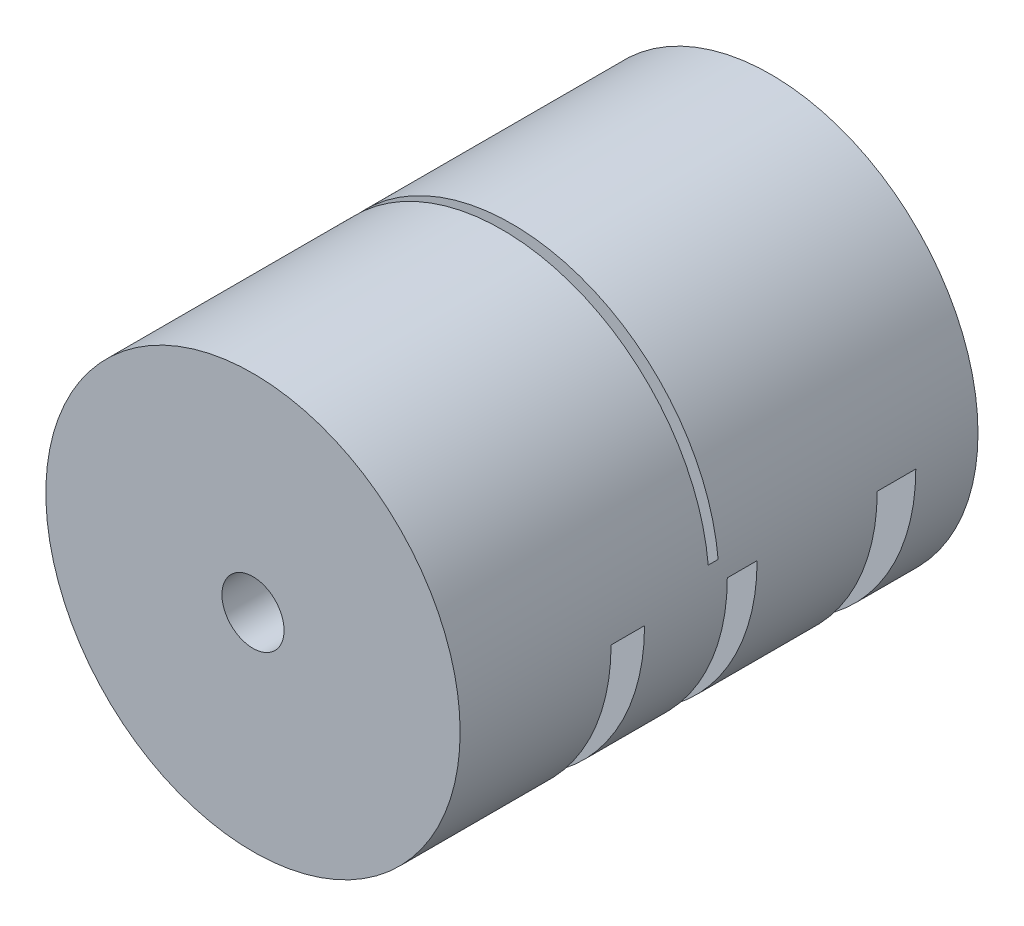
ISO-10303-21;
HEADER;
FILE_DESCRIPTION(('STEP AP214'),'2;1');
FILE_NAME('part.step','',(''),(''),'','','');
FILE_SCHEMA(('AUTOMOTIVE_DESIGN { 1 0 10303 214 1 1 1 1 }'));
ENDSEC;
DATA;
#1=APPLICATION_CONTEXT('core data for automotive mechanical design processes');
#2=APPLICATION_PROTOCOL_DEFINITION('international standard','automotive_design',2000,#1);
#3=PRODUCT_CONTEXT('',#1,'mechanical');
#4=PRODUCT('Part','Part','',(#3));
#5=PRODUCT_RELATED_PRODUCT_CATEGORY('part','',(#4));
#6=PRODUCT_DEFINITION_FORMATION('','',#4);
#7=PRODUCT_DEFINITION_CONTEXT('part definition',#1,'design');
#8=PRODUCT_DEFINITION('design','',#6,#7);
#9=PRODUCT_DEFINITION_SHAPE('','',#8);
#10=(LENGTH_UNIT() NAMED_UNIT(*) SI_UNIT(.MILLI.,.METRE.));
#11=(NAMED_UNIT(*) PLANE_ANGLE_UNIT() SI_UNIT($,.RADIAN.));
#12=(NAMED_UNIT(*) SI_UNIT($,.STERADIAN.) SOLID_ANGLE_UNIT());
#13=UNCERTAINTY_MEASURE_WITH_UNIT(LENGTH_MEASURE(1.E-05),#10,'distance_accuracy_value','');
#14=(GEOMETRIC_REPRESENTATION_CONTEXT(3) GLOBAL_UNCERTAINTY_ASSIGNED_CONTEXT((#13)) GLOBAL_UNIT_ASSIGNED_CONTEXT((#10,
#11,#12)) REPRESENTATION_CONTEXT('',''));
#15=CARTESIAN_POINT('',(0.,0.,0.));
#16=DIRECTION('',(0.,0.,1.));
#17=DIRECTION('',(1.,0.,0.));
#18=AXIS2_PLACEMENT_3D('',#15,#16,#17);
#19=CARTESIAN_POINT('',(0.,0.,25.));
#20=DIRECTION('',(0.,0.,-1.));
#21=DIRECTION('',(-1.,0.,0.));
#22=AXIS2_PLACEMENT_3D('',#19,#20,#21);
#23=CYLINDRICAL_SURFACE('',#22,3.);
#24=CARTESIAN_POINT('',(0.,0.,10.4261161368343));
#25=DIRECTION('',(0.,0.,1.));
#26=DIRECTION('',(1.,0.,0.));
#27=AXIS2_PLACEMENT_3D('',#24,#25,#26);
#28=CIRCLE('',#27,3.);
#29=CARTESIAN_POINT('',(-3.,0.,10.4261161368343));
#30=VERTEX_POINT('',#29);
#31=CARTESIAN_POINT('',(3.,0.,10.4261161368343));
#32=VERTEX_POINT('',#31);
#33=EDGE_CURVE('E62',#30,#32,#28,.T.);
#34=ORIENTED_EDGE('',*,*,#33,.F.);
#35=DIRECTION('',(0.,0.,-1.));
#36=VECTOR('',#35,1.);
#37=CARTESIAN_POINT('',(-3.,0.,25.));
#38=LINE('',#37,#36);
#39=CARTESIAN_POINT('',(-3.,0.,7.19606312437256));
#40=VERTEX_POINT('',#39);
#41=EDGE_CURVE('E268',#40,#30,#38,.F.);
#42=ORIENTED_EDGE('',*,*,#41,.F.);
#43=CARTESIAN_POINT('',(0.,0.,7.19606312437256));
#44=DIRECTION('',(0.,0.,-1.));
#45=DIRECTION('',(-1.,0.,0.));
#46=AXIS2_PLACEMENT_3D('',#43,#44,#45);
#47=CIRCLE('',#46,3.);
#48=CARTESIAN_POINT('',(3.,0.,7.19606312437256));
#49=VERTEX_POINT('',#48);
#50=EDGE_CURVE('E270',#49,#40,#47,.T.);
#51=ORIENTED_EDGE('',*,*,#50,.F.);
#52=DIRECTION('',(0.,0.,-1.));
#53=VECTOR('',#52,1.);
#54=CARTESIAN_POINT('',(3.,0.,25.));
#55=LINE('',#54,#53);
#56=EDGE_CURVE('E274',#32,#49,#55,.T.);
#57=ORIENTED_EDGE('',*,*,#56,.F.);
#58=EDGE_LOOP('',(#34,#42,#51,#57));
#59=FACE_BOUND('',#58,.T.);
#60=CARTESIAN_POINT('',(0.,0.,-0.793981947598436));
#61=DIRECTION('',(0.,0.,1.));
#62=DIRECTION('',(1.,0.,0.));
#63=AXIS2_PLACEMENT_3D('',#60,#61,#62);
#64=CIRCLE('',#63,3.);
#65=CARTESIAN_POINT('',(-3.,0.,-0.793981947598436));
#66=VERTEX_POINT('',#65);
#67=CARTESIAN_POINT('',(3.,0.,-0.793981947598436));
#68=VERTEX_POINT('',#67);
#69=EDGE_CURVE('E259',#66,#68,#64,.T.);
#70=ORIENTED_EDGE('',*,*,#69,.F.);
#71=DIRECTION('',(0.,0.,-1.));
#72=VECTOR('',#71,1.);
#73=CARTESIAN_POINT('',(-3.,0.,25.));
#74=LINE('',#73,#72);
#75=CARTESIAN_POINT('',(-3.,0.,-3.67142087285081));
#76=VERTEX_POINT('',#75);
#77=EDGE_CURVE('E256',#76,#66,#74,.F.);
#78=ORIENTED_EDGE('',*,*,#77,.F.);
#79=CARTESIAN_POINT('',(0.,0.,-3.67142087285081));
#80=DIRECTION('',(0.,0.,-1.));
#81=DIRECTION('',(-1.,0.,0.));
#82=AXIS2_PLACEMENT_3D('',#79,#80,#81);
#83=CIRCLE('',#82,3.);
#84=CARTESIAN_POINT('',(3.,0.,-3.67142087285081));
#85=VERTEX_POINT('',#84);
#86=EDGE_CURVE('E262',#85,#76,#83,.T.);
#87=ORIENTED_EDGE('',*,*,#86,.F.);
#88=DIRECTION('',(0.,0.,-1.));
#89=VECTOR('',#88,1.);
#90=CARTESIAN_POINT('',(3.,0.,25.));
#91=LINE('',#90,#89);
#92=EDGE_CURVE('E265',#68,#85,#91,.T.);
#93=ORIENTED_EDGE('',*,*,#92,.F.);
#94=EDGE_LOOP('',(#70,#78,#87,#93));
#95=FACE_BOUND('',#94,.T.);
#96=CARTESIAN_POINT('',(0.,0.,25.));
#97=DIRECTION('',(0.,0.,-1.));
#98=DIRECTION('',(-1.,0.,0.));
#99=AXIS2_PLACEMENT_3D('',#96,#97,#98);
#100=CIRCLE('',#99,3.);
#101=CARTESIAN_POINT('',(-3.,0.,25.));
#102=VERTEX_POINT('',#101);
#103=EDGE_CURVE('E249',#102,#102,#100,.T.);
#104=ORIENTED_EDGE('',*,*,#103,.F.);
#105=EDGE_LOOP('',(#104));
#106=FACE_BOUND('',#105,.T.);
#107=DIRECTION('',(0.,0.,-1.));
#108=VECTOR('',#107,1.);
#109=CARTESIAN_POINT('',(3.,0.,25.));
#110=LINE('',#109,#108);
#111=CARTESIAN_POINT('',(3.,0.,0.954143846726332));
#112=VERTEX_POINT('',#111);
#113=CARTESIAN_POINT('',(3.,0.,0.));
#114=VERTEX_POINT('',#113);
#115=EDGE_CURVE('E48',#112,#114,#110,.T.);
#116=ORIENTED_EDGE('',*,*,#115,.T.);
#117=CARTESIAN_POINT('',(0.,0.,0.));
#118=DIRECTION('',(0.,0.,1.));
#119=DIRECTION('',(1.,0.,0.));
#120=AXIS2_PLACEMENT_3D('',#117,#118,#119);
#121=CIRCLE('',#120,3.);
#122=CARTESIAN_POINT('',(-3.,0.,0.));
#123=VERTEX_POINT('',#122);
#124=EDGE_CURVE('E252',#114,#123,#121,.T.);
#125=ORIENTED_EDGE('',*,*,#124,.T.);
#126=DIRECTION('',(0.,0.,-1.));
#127=VECTOR('',#126,1.);
#128=CARTESIAN_POINT('',(-3.,0.,25.));
#129=LINE('',#128,#127);
#130=CARTESIAN_POINT('',(-3.,0.,0.954143846726332));
#131=VERTEX_POINT('',#130);
#132=EDGE_CURVE('E230',#123,#131,#129,.F.);
#133=ORIENTED_EDGE('',*,*,#132,.T.);
#134=CARTESIAN_POINT('',(0.,0.,0.954143846726332));
#135=DIRECTION('',(0.,0.,-1.));
#136=DIRECTION('',(-1.,0.,0.));
#137=AXIS2_PLACEMENT_3D('',#134,#135,#136);
#138=CIRCLE('',#137,3.);
#139=EDGE_CURVE('E254',#131,#112,#138,.T.);
#140=ORIENTED_EDGE('',*,*,#139,.T.);
#141=EDGE_LOOP('',(#116,#125,#133,#140));
#142=FACE_BOUND('',#141,.T.);
#143=CARTESIAN_POINT('',(0.,0.,-15.));
#144=DIRECTION('',(0.,0.,-1.));
#145=DIRECTION('',(-1.,0.,0.));
#146=AXIS2_PLACEMENT_3D('',#143,#144,#145);
#147=CIRCLE('',#146,3.);
#148=CARTESIAN_POINT('',(-3.,0.,-15.));
#149=VERTEX_POINT('',#148);
#150=EDGE_CURVE('E234',#149,#149,#147,.F.);
#151=ORIENTED_EDGE('',*,*,#150,.F.);
#152=EDGE_LOOP('',(#151));
#153=FACE_BOUND('',#152,.T.);
#154=ADVANCED_FACE('F40',(#59,#95,#106,#142,#153),#23,.F.);
#155=CARTESIAN_POINT('',(0.,0.,0.));
#156=DIRECTION('',(0.,1.,0.));
#157=DIRECTION('',(0.,0.,1.));
#158=AXIS2_PLACEMENT_3D('',#155,#156,#157);
#159=PLANE('',#158);
#160=DIRECTION('',(1.,0.,0.));
#161=VECTOR('',#160,1.);
#162=CARTESIAN_POINT('',(23.2953475946034,0.,10.4261161368343));
#163=LINE('',#162,#161);
#164=CARTESIAN_POINT('',(20.,0.,10.4261161368343));
#165=VERTEX_POINT('',#164);
#166=EDGE_CURVE('E218',#32,#165,#163,.T.);
#167=ORIENTED_EDGE('',*,*,#166,.F.);
#168=ORIENTED_EDGE('',*,*,#56,.T.);
#169=DIRECTION('',(-1.,0.,0.));
#170=VECTOR('',#169,1.);
#171=CARTESIAN_POINT('',(23.2953475946034,0.,7.19606312437256));
#172=LINE('',#171,#170);
#173=CARTESIAN_POINT('',(20.,0.,7.19606312437256));
#174=VERTEX_POINT('',#173);
#175=EDGE_CURVE('E215',#174,#49,#172,.T.);
#176=ORIENTED_EDGE('',*,*,#175,.F.);
#177=DIRECTION('',(0.,0.,-1.));
#178=VECTOR('',#177,1.);
#179=CARTESIAN_POINT('',(20.,0.,25.));
#180=LINE('',#179,#178);
#181=EDGE_CURVE('E190',#174,#165,#180,.F.);
#182=ORIENTED_EDGE('',*,*,#181,.T.);
#183=EDGE_LOOP('',(#167,#168,#176,#182));
#184=FACE_BOUND('',#183,.T.);
#185=ADVANCED_FACE('F342',(#184),#159,.F.);
#186=CARTESIAN_POINT('',(0.,0.,0.));
#187=DIRECTION('',(0.,1.,0.));
#188=DIRECTION('',(0.,0.,1.));
#189=AXIS2_PLACEMENT_3D('',#186,#187,#188);
#190=PLANE('',#189);
#191=DIRECTION('',(1.,0.,0.));
#192=VECTOR('',#191,1.);
#193=CARTESIAN_POINT('',(-22.0590214300708,0.,-0.793981947598436));
#194=LINE('',#193,#192);
#195=CARTESIAN_POINT('',(20.,0.,-0.793981947598436));
#196=VERTEX_POINT('',#195);
#197=EDGE_CURVE('E193',#68,#196,#194,.T.);
#198=ORIENTED_EDGE('',*,*,#197,.F.);
#199=ORIENTED_EDGE('',*,*,#92,.T.);
#200=DIRECTION('',(-1.,0.,0.));
#201=VECTOR('',#200,1.);
#202=CARTESIAN_POINT('',(-22.0590214300708,0.,-3.67142087285081));
#203=LINE('',#202,#201);
#204=CARTESIAN_POINT('',(20.,0.,-3.67142087285081));
#205=VERTEX_POINT('',#204);
#206=EDGE_CURVE('E198',#205,#85,#203,.T.);
#207=ORIENTED_EDGE('',*,*,#206,.F.);
#208=DIRECTION('',(0.,0.,-1.));
#209=VECTOR('',#208,1.);
#210=CARTESIAN_POINT('',(20.,0.,25.));
#211=LINE('',#210,#209);
#212=EDGE_CURVE('E204',#205,#196,#211,.F.);
#213=ORIENTED_EDGE('',*,*,#212,.T.);
#214=EDGE_LOOP('',(#198,#199,#207,#213));
#215=FACE_BOUND('',#214,.T.);
#216=ADVANCED_FACE('F347',(#215),#190,.F.);
#217=CARTESIAN_POINT('',(0.,0.,0.));
#218=DIRECTION('',(0.,1.,0.));
#219=DIRECTION('',(0.,0.,1.));
#220=AXIS2_PLACEMENT_3D('',#217,#218,#219);
#221=PLANE('',#220);
#222=DIRECTION('',(1.,0.,0.));
#223=VECTOR('',#222,1.);
#224=CARTESIAN_POINT('',(-22.0590214300708,0.,-15.2691684318328));
#225=LINE('',#224,#223);
#226=CARTESIAN_POINT('',(4.,0.,-15.2691684318328));
#227=VERTEX_POINT('',#226);
#228=CARTESIAN_POINT('',(20.,0.,-15.2691684318328));
#229=VERTEX_POINT('',#228);
#230=EDGE_CURVE('E178',#227,#229,#225,.T.);
#231=ORIENTED_EDGE('',*,*,#230,.F.);
#232=DIRECTION('',(0.,0.,-1.));
#233=VECTOR('',#232,1.);
#234=CARTESIAN_POINT('',(4.,0.,-15.));
#235=LINE('',#234,#233);
#236=CARTESIAN_POINT('',(4.,0.,-18.9939233758882));
#237=VERTEX_POINT('',#236);
#238=EDGE_CURVE('E170',#227,#237,#235,.T.);
#239=ORIENTED_EDGE('',*,*,#238,.T.);
#240=DIRECTION('',(-1.,0.,0.));
#241=VECTOR('',#240,1.);
#242=CARTESIAN_POINT('',(-22.0590214300708,0.,-18.9939233758882));
#243=LINE('',#242,#241);
#244=CARTESIAN_POINT('',(20.,0.,-18.9939233758882));
#245=VERTEX_POINT('',#244);
#246=EDGE_CURVE('E169',#245,#237,#243,.T.);
#247=ORIENTED_EDGE('',*,*,#246,.F.);
#248=DIRECTION('',(0.,0.,-1.));
#249=VECTOR('',#248,1.);
#250=CARTESIAN_POINT('',(20.,0.,25.));
#251=LINE('',#250,#249);
#252=EDGE_CURVE('E183',#245,#229,#251,.F.);
#253=ORIENTED_EDGE('',*,*,#252,.T.);
#254=EDGE_LOOP('',(#231,#239,#247,#253));
#255=FACE_BOUND('',#254,.T.);
#256=ADVANCED_FACE('F311',(#255),#221,.F.);
#257=CARTESIAN_POINT('',(0.,0.,0.));
#258=DIRECTION('',(0.,1.,0.));
#259=DIRECTION('',(0.,0.,1.));
#260=AXIS2_PLACEMENT_3D('',#257,#258,#259);
#261=PLANE('',#260);
#262=ORIENTED_EDGE('',*,*,#115,.F.);
#263=DIRECTION('',(1.,0.,0.));
#264=VECTOR('',#263,1.);
#265=CARTESIAN_POINT('',(-20.,0.,0.954143846726332));
#266=LINE('',#265,#264);
#267=CARTESIAN_POINT('',(19.9098016016895,0.,0.954143846726332));
#268=VERTEX_POINT('',#267);
#269=EDGE_CURVE('E289',#112,#268,#266,.T.);
#270=ORIENTED_EDGE('',*,*,#269,.T.);
#271=DIRECTION('',(0.,0.,-1.));
#272=VECTOR('',#271,1.);
#273=CARTESIAN_POINT('',(19.9098016016895,0.,0.));
#274=LINE('',#273,#272);
#275=CARTESIAN_POINT('',(19.9098016016895,0.,0.));
#276=VERTEX_POINT('',#275);
#277=EDGE_CURVE('E293',#268,#276,#274,.T.);
#278=ORIENTED_EDGE('',*,*,#277,.T.);
#279=DIRECTION('',(-1.,0.,0.));
#280=VECTOR('',#279,1.);
#281=CARTESIAN_POINT('',(-20.,0.,0.));
#282=LINE('',#281,#280);
#283=EDGE_CURVE('E297',#276,#114,#282,.T.);
#284=ORIENTED_EDGE('',*,*,#283,.T.);
#285=EDGE_LOOP('',(#262,#270,#278,#284));
#286=FACE_BOUND('',#285,.T.);
#287=ADVANCED_FACE('F316',(#286),#261,.T.);
#288=CARTESIAN_POINT('',(0.,0.,25.));
#289=DIRECTION('',(0.,0.,-1.));
#290=DIRECTION('',(-1.,0.,0.));
#291=AXIS2_PLACEMENT_3D('',#288,#289,#290);
#292=CYLINDRICAL_SURFACE('',#291,20.);
#293=CARTESIAN_POINT('',(0.,0.,-25.));
#294=DIRECTION('',(0.,0.,1.));
#295=DIRECTION('',(1.,0.,0.));
#296=AXIS2_PLACEMENT_3D('',#293,#294,#295);
#297=CIRCLE('',#296,20.);
#298=CARTESIAN_POINT('',(20.,0.,-25.));
#299=VERTEX_POINT('',#298);
#300=EDGE_CURVE('E186',#299,#299,#297,.T.);
#301=ORIENTED_EDGE('',*,*,#300,.T.);
#302=EDGE_LOOP('',(#301));
#303=FACE_BOUND('',#302,.T.);
#304=CARTESIAN_POINT('',(0.,0.,25.));
#305=DIRECTION('',(0.,0.,1.));
#306=DIRECTION('',(1.,0.,0.));
#307=AXIS2_PLACEMENT_3D('',#304,#305,#306);
#308=CIRCLE('',#307,20.);
#309=CARTESIAN_POINT('',(20.,0.,25.));
#310=VERTEX_POINT('',#309);
#311=EDGE_CURVE('E227',#310,#310,#308,.T.);
#312=ORIENTED_EDGE('',*,*,#311,.F.);
#313=EDGE_LOOP('',(#312));
#314=FACE_BOUND('',#313,.T.);
#315=CARTESIAN_POINT('',(0.,0.,10.4261161368343));
#316=DIRECTION('',(0.,0.,1.));
#317=DIRECTION('',(1.,0.,0.));
#318=AXIS2_PLACEMENT_3D('',#315,#316,#317);
#319=CIRCLE('',#318,20.);
#320=CARTESIAN_POINT('',(-20.,0.,10.4261161368343));
#321=VERTEX_POINT('',#320);
#322=EDGE_CURVE('E211',#165,#321,#319,.F.);
#323=ORIENTED_EDGE('',*,*,#322,.F.);
#324=ORIENTED_EDGE('',*,*,#181,.F.);
#325=CARTESIAN_POINT('',(0.,0.,7.19606312437256));
#326=DIRECTION('',(0.,0.,-1.));
#327=DIRECTION('',(-1.,0.,0.));
#328=AXIS2_PLACEMENT_3D('',#325,#326,#327);
#329=CIRCLE('',#328,20.);
#330=CARTESIAN_POINT('',(-20.,0.,7.19606312437256));
#331=VERTEX_POINT('',#330);
#332=EDGE_CURVE('E208',#331,#174,#329,.F.);
#333=ORIENTED_EDGE('',*,*,#332,.F.);
#334=DIRECTION('',(0.,0.,-1.));
#335=VECTOR('',#334,1.);
#336=CARTESIAN_POINT('',(-20.,0.,25.));
#337=LINE('',#336,#335);
#338=EDGE_CURVE('E222',#321,#331,#337,.T.);
#339=ORIENTED_EDGE('',*,*,#338,.F.);
#340=EDGE_LOOP('',(#323,#324,#333,#339));
#341=FACE_BOUND('',#340,.T.);
#342=CARTESIAN_POINT('',(0.,0.,-0.793981947598436));
#343=DIRECTION('',(0.,0.,1.));
#344=DIRECTION('',(1.,0.,0.));
#345=AXIS2_PLACEMENT_3D('',#342,#343,#344);
#346=CIRCLE('',#345,20.);
#347=CARTESIAN_POINT('',(-20.,0.,-0.793981947598436));
#348=VERTEX_POINT('',#347);
#349=EDGE_CURVE('E187',#196,#348,#346,.F.);
#350=ORIENTED_EDGE('',*,*,#349,.F.);
#351=ORIENTED_EDGE('',*,*,#212,.F.);
#352=CARTESIAN_POINT('',(0.,0.,-3.67142087285081));
#353=DIRECTION('',(0.,0.,-1.));
#354=DIRECTION('',(-1.,0.,0.));
#355=AXIS2_PLACEMENT_3D('',#352,#353,#354);
#356=CIRCLE('',#355,20.);
#357=CARTESIAN_POINT('',(-20.,0.,-3.67142087285081));
#358=VERTEX_POINT('',#357);
#359=EDGE_CURVE('E189',#358,#205,#356,.F.);
#360=ORIENTED_EDGE('',*,*,#359,.F.);
#361=DIRECTION('',(0.,0.,-1.));
#362=VECTOR('',#361,1.);
#363=CARTESIAN_POINT('',(-20.,0.,25.));
#364=LINE('',#363,#362);
#365=EDGE_CURVE('E201',#348,#358,#364,.T.);
#366=ORIENTED_EDGE('',*,*,#365,.F.);
#367=EDGE_LOOP('',(#350,#351,#360,#366));
#368=FACE_BOUND('',#367,.T.);
#369=CARTESIAN_POINT('',(0.,0.,-15.2691684318328));
#370=DIRECTION('',(0.,0.,1.));
#371=DIRECTION('',(1.,0.,0.));
#372=AXIS2_PLACEMENT_3D('',#369,#370,#371);
#373=CIRCLE('',#372,20.);
#374=CARTESIAN_POINT('',(-20.,0.,-15.2691684318328));
#375=VERTEX_POINT('',#374);
#376=EDGE_CURVE('E207',#229,#375,#373,.F.);
#377=ORIENTED_EDGE('',*,*,#376,.F.);
#378=ORIENTED_EDGE('',*,*,#252,.F.);
#379=CARTESIAN_POINT('',(0.,0.,-18.9939233758882));
#380=DIRECTION('',(0.,0.,-1.));
#381=DIRECTION('',(-1.,0.,0.));
#382=AXIS2_PLACEMENT_3D('',#379,#380,#381);
#383=CIRCLE('',#382,20.);
#384=CARTESIAN_POINT('',(-20.,0.,-18.9939233758882));
#385=VERTEX_POINT('',#384);
#386=EDGE_CURVE('E304',#385,#245,#383,.F.);
#387=ORIENTED_EDGE('',*,*,#386,.F.);
#388=DIRECTION('',(0.,0.,-1.));
#389=VECTOR('',#388,1.);
#390=CARTESIAN_POINT('',(-20.,0.,25.));
#391=LINE('',#390,#389);
#392=EDGE_CURVE('E174',#375,#385,#391,.T.);
#393=ORIENTED_EDGE('',*,*,#392,.F.);
#394=EDGE_LOOP('',(#377,#378,#387,#393));
#395=FACE_BOUND('',#394,.T.);
#396=CARTESIAN_POINT('',(0.,0.,0.954143846726332));
#397=DIRECTION('',(0.,0.,-1.));
#398=DIRECTION('',(-1.,0.,0.));
#399=AXIS2_PLACEMENT_3D('',#396,#397,#398);
#400=CIRCLE('',#399,20.);
#401=CARTESIAN_POINT('',(19.9098016016895,1.89731393853601,0.954143846726332));
#402=VERTEX_POINT('',#401);
#403=CARTESIAN_POINT('',(-20.,0.,0.954143846726332));
#404=VERTEX_POINT('',#403);
#405=EDGE_CURVE('E283',#402,#404,#400,.F.);
#406=ORIENTED_EDGE('',*,*,#405,.T.);
#407=DIRECTION('',(0.,0.,1.));
#408=VECTOR('',#407,1.);
#409=CARTESIAN_POINT('',(-20.,0.,0.));
#410=LINE('',#409,#408);
#411=CARTESIAN_POINT('',(-20.,0.,0.));
#412=VERTEX_POINT('',#411);
#413=EDGE_CURVE('E286',#412,#404,#410,.T.);
#414=ORIENTED_EDGE('',*,*,#413,.F.);
#415=CARTESIAN_POINT('',(0.,0.,0.));
#416=DIRECTION('',(0.,0.,1.));
#417=DIRECTION('',(1.,0.,0.));
#418=AXIS2_PLACEMENT_3D('',#415,#416,#417);
#419=CIRCLE('',#418,20.);
#420=CARTESIAN_POINT('',(19.9098016016895,1.89731393853601,0.));
#421=VERTEX_POINT('',#420);
#422=EDGE_CURVE('E277',#412,#421,#419,.F.);
#423=ORIENTED_EDGE('',*,*,#422,.T.);
#424=DIRECTION('',(0.,0.,-1.));
#425=VECTOR('',#424,1.);
#426=CARTESIAN_POINT('',(19.9098016016895,1.89731393853601,25.));
#427=LINE('',#426,#425);
#428=EDGE_CURVE('E280',#421,#402,#427,.F.);
#429=ORIENTED_EDGE('',*,*,#428,.T.);
#430=EDGE_LOOP('',(#406,#414,#423,#429));
#431=FACE_BOUND('',#430,.T.);
#432=ADVANCED_FACE('F42',(#303,#314,#341,#368,#395,#431),#292,.T.);
#433=CARTESIAN_POINT('',(0.,0.,25.));
#434=DIRECTION('',(0.,0.,1.));
#435=DIRECTION('',(1.,0.,0.));
#436=AXIS2_PLACEMENT_3D('',#433,#434,#435);
#437=PLANE('',#436);
#438=ORIENTED_EDGE('',*,*,#103,.T.);
#439=EDGE_LOOP('',(#438));
#440=FACE_BOUND('',#439,.T.);
#441=ORIENTED_EDGE('',*,*,#311,.T.);
#442=EDGE_LOOP('',(#441));
#443=FACE_BOUND('',#442,.T.);
#444=ADVANCED_FACE('F315',(#440,#443),#437,.T.);
#445=CARTESIAN_POINT('',(0.,0.,-25.));
#446=DIRECTION('',(0.,0.,1.));
#447=DIRECTION('',(1.,0.,0.));
#448=AXIS2_PLACEMENT_3D('',#445,#446,#447);
#449=PLANE('',#448);
#450=CARTESIAN_POINT('',(0.,0.,-25.));
#451=DIRECTION('',(0.,0.,-1.));
#452=DIRECTION('',(-1.,0.,0.));
#453=AXIS2_PLACEMENT_3D('',#450,#451,#452);
#454=CIRCLE('',#453,4.);
#455=CARTESIAN_POINT('',(-4.,0.,-25.));
#456=VERTEX_POINT('',#455);
#457=EDGE_CURVE('E241',#456,#456,#454,.T.);
#458=ORIENTED_EDGE('',*,*,#457,.F.);
#459=EDGE_LOOP('',(#458));
#460=FACE_BOUND('',#459,.T.);
#461=ORIENTED_EDGE('',*,*,#300,.F.);
#462=EDGE_LOOP('',(#461));
#463=FACE_BOUND('',#462,.T.);
#464=ADVANCED_FACE('F387',(#460,#463),#449,.F.);
#465=CARTESIAN_POINT('',(23.2953475946034,-20.001,10.4261161368343));
#466=DIRECTION('',(0.,0.,1.));
#467=DIRECTION('',(1.,0.,0.));
#468=AXIS2_PLACEMENT_3D('',#465,#466,#467);
#469=PLANE('',#468);
#470=EDGE_CURVE('E219',#321,#30,#163,.T.);
#471=ORIENTED_EDGE('',*,*,#470,.T.);
#472=ORIENTED_EDGE('',*,*,#33,.T.);
#473=ORIENTED_EDGE('',*,*,#166,.T.);
#474=ORIENTED_EDGE('',*,*,#322,.T.);
#475=EDGE_LOOP('',(#471,#472,#473,#474));
#476=FACE_BOUND('',#475,.T.);
#477=ADVANCED_FACE('F384',(#476),#469,.F.);
#478=CARTESIAN_POINT('',(23.2953475946034,-20.001,7.19606312437256));
#479=DIRECTION('',(0.,0.,-1.));
#480=DIRECTION('',(-1.,0.,0.));
#481=AXIS2_PLACEMENT_3D('',#478,#479,#480);
#482=PLANE('',#481);
#483=ORIENTED_EDGE('',*,*,#175,.T.);
#484=ORIENTED_EDGE('',*,*,#50,.T.);
#485=EDGE_CURVE('E214',#40,#331,#172,.T.);
#486=ORIENTED_EDGE('',*,*,#485,.T.);
#487=ORIENTED_EDGE('',*,*,#332,.T.);
#488=EDGE_LOOP('',(#483,#484,#486,#487));
#489=FACE_BOUND('',#488,.T.);
#490=ADVANCED_FACE('F382',(#489),#482,.F.);
#491=ORIENTED_EDGE('',*,*,#485,.F.);
#492=ORIENTED_EDGE('',*,*,#41,.T.);
#493=ORIENTED_EDGE('',*,*,#470,.F.);
#494=ORIENTED_EDGE('',*,*,#338,.T.);
#495=EDGE_LOOP('',(#491,#492,#493,#494));
#496=FACE_BOUND('',#495,.T.);
#497=ADVANCED_FACE('F350',(#496),#159,.F.);
#498=CARTESIAN_POINT('',(-22.0590214300708,-20.001,-3.67142087285081));
#499=DIRECTION('',(0.,0.,-1.));
#500=DIRECTION('',(-1.,0.,0.));
#501=AXIS2_PLACEMENT_3D('',#498,#499,#500);
#502=PLANE('',#501);
#503=ORIENTED_EDGE('',*,*,#206,.T.);
#504=ORIENTED_EDGE('',*,*,#86,.T.);
#505=EDGE_CURVE('E197',#76,#358,#203,.T.);
#506=ORIENTED_EDGE('',*,*,#505,.T.);
#507=ORIENTED_EDGE('',*,*,#359,.T.);
#508=EDGE_LOOP('',(#503,#504,#506,#507));
#509=FACE_BOUND('',#508,.T.);
#510=ADVANCED_FACE('F374',(#509),#502,.F.);
#511=CARTESIAN_POINT('',(-22.0590214300708,-20.001,-0.793981947598436));
#512=DIRECTION('',(0.,0.,1.));
#513=DIRECTION('',(1.,0.,0.));
#514=AXIS2_PLACEMENT_3D('',#511,#512,#513);
#515=PLANE('',#514);
#516=EDGE_CURVE('E194',#348,#66,#194,.T.);
#517=ORIENTED_EDGE('',*,*,#516,.T.);
#518=ORIENTED_EDGE('',*,*,#69,.T.);
#519=ORIENTED_EDGE('',*,*,#197,.T.);
#520=ORIENTED_EDGE('',*,*,#349,.T.);
#521=EDGE_LOOP('',(#517,#518,#519,#520));
#522=FACE_BOUND('',#521,.T.);
#523=ADVANCED_FACE('F372',(#522),#515,.F.);
#524=ORIENTED_EDGE('',*,*,#505,.F.);
#525=ORIENTED_EDGE('',*,*,#77,.T.);
#526=ORIENTED_EDGE('',*,*,#516,.F.);
#527=ORIENTED_EDGE('',*,*,#365,.T.);
#528=EDGE_LOOP('',(#524,#525,#526,#527));
#529=FACE_BOUND('',#528,.T.);
#530=ADVANCED_FACE('F367',(#529),#190,.F.);
#531=CARTESIAN_POINT('',(-22.0590214300708,-20.001,-18.9939233758882));
#532=DIRECTION('',(0.,0.,-1.));
#533=DIRECTION('',(-1.,0.,0.));
#534=AXIS2_PLACEMENT_3D('',#531,#532,#533);
#535=PLANE('',#534);
#536=ORIENTED_EDGE('',*,*,#246,.T.);
#537=CARTESIAN_POINT('',(0.,0.,-18.9939233758882));
#538=DIRECTION('',(0.,0.,-1.));
#539=DIRECTION('',(-1.,0.,0.));
#540=AXIS2_PLACEMENT_3D('',#537,#538,#539);
#541=CIRCLE('',#540,4.);
#542=CARTESIAN_POINT('',(-4.,0.,-18.9939233758882));
#543=VERTEX_POINT('',#542);
#544=EDGE_CURVE('E157',#237,#543,#541,.T.);
#545=ORIENTED_EDGE('',*,*,#544,.T.);
#546=EDGE_CURVE('E167',#543,#385,#243,.T.);
#547=ORIENTED_EDGE('',*,*,#546,.T.);
#548=ORIENTED_EDGE('',*,*,#386,.T.);
#549=EDGE_LOOP('',(#536,#545,#547,#548));
#550=FACE_BOUND('',#549,.T.);
#551=ADVANCED_FACE('F165',(#550),#535,.F.);
#552=CARTESIAN_POINT('',(-22.0590214300708,-20.001,-15.2691684318328));
#553=DIRECTION('',(0.,0.,1.));
#554=DIRECTION('',(1.,0.,0.));
#555=AXIS2_PLACEMENT_3D('',#552,#553,#554);
#556=PLANE('',#555);
#557=CARTESIAN_POINT('',(-4.,0.,-15.2691684318328));
#558=VERTEX_POINT('',#557);
#559=EDGE_CURVE('E176',#375,#558,#225,.T.);
#560=ORIENTED_EDGE('',*,*,#559,.T.);
#561=CARTESIAN_POINT('',(0.,0.,-15.2691684318328));
#562=DIRECTION('',(0.,0.,1.));
#563=DIRECTION('',(1.,0.,0.));
#564=AXIS2_PLACEMENT_3D('',#561,#562,#563);
#565=CIRCLE('',#564,4.);
#566=EDGE_CURVE('E55',#558,#227,#565,.T.);
#567=ORIENTED_EDGE('',*,*,#566,.T.);
#568=ORIENTED_EDGE('',*,*,#230,.T.);
#569=ORIENTED_EDGE('',*,*,#376,.T.);
#570=EDGE_LOOP('',(#560,#567,#568,#569));
#571=FACE_BOUND('',#570,.T.);
#572=ADVANCED_FACE('F308',(#571),#556,.F.);
#573=ORIENTED_EDGE('',*,*,#546,.F.);
#574=DIRECTION('',(0.,0.,-1.));
#575=VECTOR('',#574,1.);
#576=CARTESIAN_POINT('',(-4.,0.,-15.));
#577=LINE('',#576,#575);
#578=EDGE_CURVE('E11',#543,#558,#577,.F.);
#579=ORIENTED_EDGE('',*,*,#578,.T.);
#580=ORIENTED_EDGE('',*,*,#559,.F.);
#581=ORIENTED_EDGE('',*,*,#392,.T.);
#582=EDGE_LOOP('',(#573,#579,#580,#581));
#583=FACE_BOUND('',#582,.T.);
#584=ADVANCED_FACE('F172',(#583),#221,.F.);
#585=CARTESIAN_POINT('',(-20.,20.001,0.954143846726332));
#586=DIRECTION('',(0.,0.,-1.));
#587=DIRECTION('',(-1.,0.,0.));
#588=AXIS2_PLACEMENT_3D('',#585,#586,#587);
#589=PLANE('',#588);
#590=ORIENTED_EDGE('',*,*,#139,.F.);
#591=EDGE_CURVE('E290',#404,#131,#266,.T.);
#592=ORIENTED_EDGE('',*,*,#591,.F.);
#593=ORIENTED_EDGE('',*,*,#405,.F.);
#594=DIRECTION('',(0.,-1.,0.));
#595=VECTOR('',#594,1.);
#596=CARTESIAN_POINT('',(19.9098016016895,20.001,0.954143846726332));
#597=LINE('',#596,#595);
#598=EDGE_CURVE('E212',#402,#268,#597,.T.);
#599=ORIENTED_EDGE('',*,*,#598,.T.);
#600=ORIENTED_EDGE('',*,*,#269,.F.);
#601=EDGE_LOOP('',(#590,#592,#593,#599,#600));
#602=FACE_BOUND('',#601,.T.);
#603=ADVANCED_FACE('F323',(#602),#589,.T.);
#604=CARTESIAN_POINT('',(19.9098016016895,20.001,0.));
#605=DIRECTION('',(-1.,0.,0.));
#606=DIRECTION('',(0.,0.,1.));
#607=AXIS2_PLACEMENT_3D('',#604,#605,#606);
#608=PLANE('',#607);
#609=DIRECTION('',(0.,-1.,0.));
#610=VECTOR('',#609,1.);
#611=CARTESIAN_POINT('',(19.9098016016895,20.001,0.));
#612=LINE('',#611,#610);
#613=EDGE_CURVE('E300',#421,#276,#612,.T.);
#614=ORIENTED_EDGE('',*,*,#613,.T.);
#615=ORIENTED_EDGE('',*,*,#277,.F.);
#616=ORIENTED_EDGE('',*,*,#598,.F.);
#617=ORIENTED_EDGE('',*,*,#428,.F.);
#618=EDGE_LOOP('',(#614,#615,#616,#617));
#619=FACE_BOUND('',#618,.T.);
#620=ADVANCED_FACE('F336',(#619),#608,.T.);
#621=CARTESIAN_POINT('',(-20.,20.001,0.));
#622=DIRECTION('',(0.,0.,1.));
#623=DIRECTION('',(1.,0.,0.));
#624=AXIS2_PLACEMENT_3D('',#621,#622,#623);
#625=PLANE('',#624);
#626=ORIENTED_EDGE('',*,*,#124,.F.);
#627=ORIENTED_EDGE('',*,*,#283,.F.);
#628=ORIENTED_EDGE('',*,*,#613,.F.);
#629=ORIENTED_EDGE('',*,*,#422,.F.);
#630=EDGE_CURVE('E296',#123,#412,#282,.T.);
#631=ORIENTED_EDGE('',*,*,#630,.F.);
#632=EDGE_LOOP('',(#626,#627,#628,#629,#631));
#633=FACE_BOUND('',#632,.T.);
#634=ADVANCED_FACE('F333',(#633),#625,.T.);
#635=ORIENTED_EDGE('',*,*,#132,.F.);
#636=ORIENTED_EDGE('',*,*,#630,.T.);
#637=ORIENTED_EDGE('',*,*,#413,.T.);
#638=ORIENTED_EDGE('',*,*,#591,.T.);
#639=EDGE_LOOP('',(#635,#636,#637,#638));
#640=FACE_BOUND('',#639,.T.);
#641=ADVANCED_FACE('F328',(#640),#261,.T.);
#642=CARTESIAN_POINT('',(0.,0.,-15.));
#643=DIRECTION('',(0.,0.,-1.));
#644=DIRECTION('',(-1.,0.,0.));
#645=AXIS2_PLACEMENT_3D('',#642,#643,#644);
#646=CYLINDRICAL_SURFACE('',#645,4.);
#647=CARTESIAN_POINT('',(0.,0.,-15.));
#648=DIRECTION('',(0.,0.,-1.));
#649=DIRECTION('',(-1.,0.,0.));
#650=AXIS2_PLACEMENT_3D('',#647,#648,#649);
#651=CIRCLE('',#650,4.);
#652=CARTESIAN_POINT('',(-4.,0.,-15.));
#653=VERTEX_POINT('',#652);
#654=EDGE_CURVE('E236',#653,#653,#651,.T.);
#655=ORIENTED_EDGE('',*,*,#654,.F.);
#656=EDGE_LOOP('',(#655));
#657=FACE_BOUND('',#656,.T.);
#658=ORIENTED_EDGE('',*,*,#457,.T.);
#659=EDGE_LOOP('',(#658));
#660=FACE_BOUND('',#659,.T.);
#661=ORIENTED_EDGE('',*,*,#566,.F.);
#662=ORIENTED_EDGE('',*,*,#578,.F.);
#663=ORIENTED_EDGE('',*,*,#544,.F.);
#664=ORIENTED_EDGE('',*,*,#238,.F.);
#665=EDGE_LOOP('',(#661,#662,#663,#664));
#666=FACE_BOUND('',#665,.T.);
#667=ADVANCED_FACE('F156',(#657,#660,#666),#646,.F.);
#668=CARTESIAN_POINT('',(0.,0.,-15.));
#669=DIRECTION('',(0.,0.,-1.));
#670=DIRECTION('',(-1.,0.,0.));
#671=AXIS2_PLACEMENT_3D('',#668,#669,#670);
#672=PLANE('',#671);
#673=ORIENTED_EDGE('',*,*,#654,.T.);
#674=EDGE_LOOP('',(#673));
#675=FACE_BOUND('',#674,.T.);
#676=ORIENTED_EDGE('',*,*,#150,.T.);
#677=EDGE_LOOP('',(#676));
#678=FACE_BOUND('',#677,.T.);
#679=ADVANCED_FACE('F531',(#675,#678),#672,.T.);
#680=CLOSED_SHELL('',(#154,#185,#216,#256,#287,#432,#444,#464,#477,#490,#497,#510,#523,#530,
#551,#572,#584,#603,#620,#634,#641,#667,#679));
#681=MANIFOLD_SOLID_BREP('B2',#680);
#682=ADVANCED_BREP_SHAPE_REPRESENTATION('',(#18,#681),#14);
#683=SHAPE_DEFINITION_REPRESENTATION(#9,#682);
ENDSEC;
END-ISO-10303-21;
